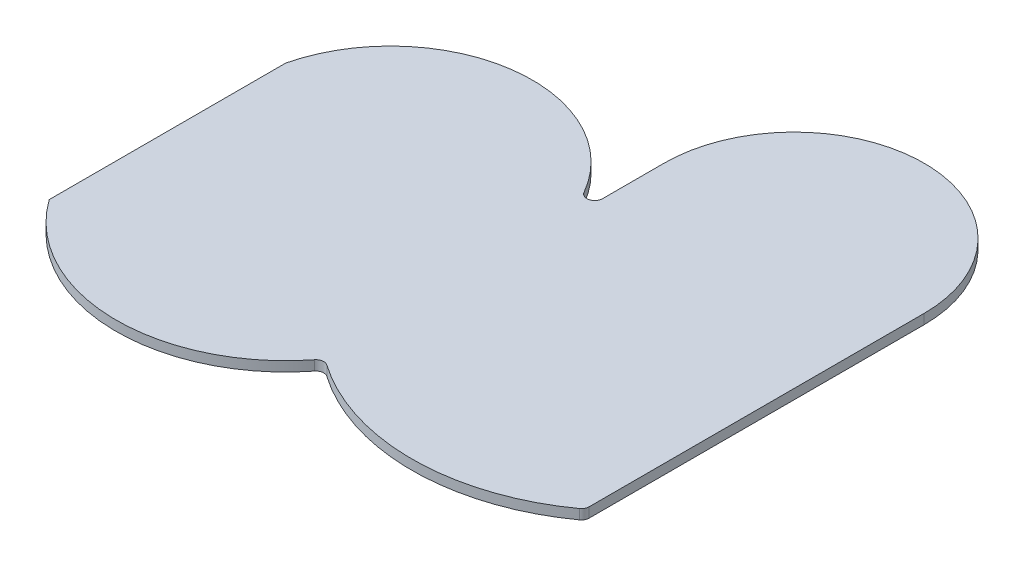
ISO-10303-21;
HEADER;
FILE_DESCRIPTION(('STEP AP214'),'2;1');
FILE_NAME('part.step','',(''),(''),'','','');
FILE_SCHEMA(('AUTOMOTIVE_DESIGN { 1 0 10303 214 1 1 1 1 }'));
ENDSEC;
DATA;
#1=APPLICATION_CONTEXT('core data for automotive mechanical design processes');
#2=APPLICATION_PROTOCOL_DEFINITION('international standard','automotive_design',2000,#1);
#3=PRODUCT_CONTEXT('',#1,'mechanical');
#4=PRODUCT('Part','Part','',(#3));
#5=PRODUCT_RELATED_PRODUCT_CATEGORY('part','',(#4));
#6=PRODUCT_DEFINITION_FORMATION('','',#4);
#7=PRODUCT_DEFINITION_CONTEXT('part definition',#1,'design');
#8=PRODUCT_DEFINITION('design','',#6,#7);
#9=PRODUCT_DEFINITION_SHAPE('','',#8);
#10=(LENGTH_UNIT() NAMED_UNIT(*) SI_UNIT(.MILLI.,.METRE.));
#11=(NAMED_UNIT(*) PLANE_ANGLE_UNIT() SI_UNIT($,.RADIAN.));
#12=(NAMED_UNIT(*) SI_UNIT($,.STERADIAN.) SOLID_ANGLE_UNIT());
#13=UNCERTAINTY_MEASURE_WITH_UNIT(LENGTH_MEASURE(1.E-05),#10,'distance_accuracy_value','');
#14=(GEOMETRIC_REPRESENTATION_CONTEXT(3) GLOBAL_UNCERTAINTY_ASSIGNED_CONTEXT((#13)) GLOBAL_UNIT_ASSIGNED_CONTEXT((#10,
#11,#12)) REPRESENTATION_CONTEXT('',''));
#15=CARTESIAN_POINT('',(0.,0.,0.));
#16=DIRECTION('',(0.,0.,1.));
#17=DIRECTION('',(1.,0.,0.));
#18=AXIS2_PLACEMENT_3D('',#15,#16,#17);
#19=CARTESIAN_POINT('',(0.,6.25,-70.));
#20=DIRECTION('',(0.,-1.,0.));
#21=DIRECTION('',(0.,0.,-1.));
#22=AXIS2_PLACEMENT_3D('',#19,#20,#21);
#23=CYLINDRICAL_SURFACE('',#22,275.);
#24=CARTESIAN_POINT('',(0.,-6.25,-70.));
#25=DIRECTION('',(0.,1.,0.));
#26=DIRECTION('',(0.,0.,1.));
#27=AXIS2_PLACEMENT_3D('',#24,#25,#26);
#28=CIRCLE('',#27,275.);
#29=CARTESIAN_POINT('',(-157.177952382668,-6.25,155.654805587632));
#30=VERTEX_POINT('',#29);
#31=CARTESIAN_POINT('',(160.849056603774,-6.25,153.052865907784));
#32=VERTEX_POINT('',#31);
#33=EDGE_CURVE('E154',#30,#32,#28,.T.);
#34=ORIENTED_EDGE('',*,*,#33,.T.);
#35=DIRECTION('',(0.,-1.,0.));
#36=VECTOR('',#35,1.);
#37=CARTESIAN_POINT('',(160.849056603774,6.25,153.052865907784));
#38=LINE('',#37,#36);
#39=CARTESIAN_POINT('',(160.849056603774,6.25,153.052865907784));
#40=VERTEX_POINT('',#39);
#41=EDGE_CURVE('E181',#32,#40,#38,.F.);
#42=ORIENTED_EDGE('',*,*,#41,.T.);
#43=CARTESIAN_POINT('',(0.,6.25,-70.));
#44=DIRECTION('',(0.,1.,0.));
#45=DIRECTION('',(0.,0.,1.));
#46=AXIS2_PLACEMENT_3D('',#43,#44,#45);
#47=CIRCLE('',#46,275.);
#48=CARTESIAN_POINT('',(-157.177952382668,6.25,155.654805587632));
#49=VERTEX_POINT('',#48);
#50=EDGE_CURVE('E127',#49,#40,#47,.T.);
#51=ORIENTED_EDGE('',*,*,#50,.F.);
#52=DIRECTION('',(0.,-1.,0.));
#53=VECTOR('',#52,1.);
#54=CARTESIAN_POINT('',(-157.177952382668,6.25,155.654805587632));
#55=LINE('',#54,#53);
#56=EDGE_CURVE('E178',#49,#30,#55,.T.);
#57=ORIENTED_EDGE('',*,*,#56,.T.);
#58=EDGE_LOOP('',(#34,#42,#51,#57));
#59=FACE_BOUND('',#58,.T.);
#60=ADVANCED_FACE('F39',(#59),#23,.T.);
#61=CARTESIAN_POINT('',(165.,6.25,-150.));
#62=DIRECTION('',(-1.,0.,0.));
#63=DIRECTION('',(0.,0.,1.));
#64=AXIS2_PLACEMENT_3D('',#61,#62,#63);
#65=PLANE('',#64);
#66=DIRECTION('',(0.,0.,-1.));
#67=VECTOR('',#66,1.);
#68=CARTESIAN_POINT('',(165.,6.25,-150.));
#69=LINE('',#68,#67);
#70=CARTESIAN_POINT('',(165.,6.25,144.941852602047));
#71=VERTEX_POINT('',#70);
#72=CARTESIAN_POINT('',(165.,6.25,-280.));
#73=VERTEX_POINT('',#72);
#74=EDGE_CURVE('E115',#71,#73,#69,.T.);
#75=ORIENTED_EDGE('',*,*,#74,.F.);
#76=DIRECTION('',(0.,-1.,0.));
#77=VECTOR('',#76,1.);
#78=CARTESIAN_POINT('',(165.,6.25,144.941852602047));
#79=LINE('',#78,#77);
#80=CARTESIAN_POINT('',(165.,-6.25,144.941852602047));
#81=VERTEX_POINT('',#80);
#82=EDGE_CURVE('E136',#71,#81,#79,.T.);
#83=ORIENTED_EDGE('',*,*,#82,.T.);
#84=DIRECTION('',(0.,0.,-1.));
#85=VECTOR('',#84,1.);
#86=CARTESIAN_POINT('',(165.,-6.25,-150.));
#87=LINE('',#86,#85);
#88=CARTESIAN_POINT('',(165.,-6.25,-280.));
#89=VERTEX_POINT('',#88);
#90=EDGE_CURVE('E133',#81,#89,#87,.T.);
#91=ORIENTED_EDGE('',*,*,#90,.T.);
#92=DIRECTION('',(0.,-1.,0.));
#93=VECTOR('',#92,1.);
#94=CARTESIAN_POINT('',(165.,6.25,-280.));
#95=LINE('',#94,#93);
#96=EDGE_CURVE('E130',#73,#89,#95,.T.);
#97=ORIENTED_EDGE('',*,*,#96,.F.);
#98=EDGE_LOOP('',(#75,#83,#91,#97));
#99=FACE_BOUND('',#98,.T.);
#100=ADVANCED_FACE('F131',(#99),#65,.F.);
#101=CARTESIAN_POINT('',(0.,6.25,-280.));
#102=DIRECTION('',(0.,-1.,0.));
#103=DIRECTION('',(0.,0.,-1.));
#104=AXIS2_PLACEMENT_3D('',#101,#102,#103);
#105=CYLINDRICAL_SURFACE('',#104,165.);
#106=CARTESIAN_POINT('',(0.,-6.25,-280.));
#107=DIRECTION('',(0.,1.,0.));
#108=DIRECTION('',(0.,0.,-1.));
#109=AXIS2_PLACEMENT_3D('',#106,#107,#108);
#110=CIRCLE('',#109,165.);
#111=CARTESIAN_POINT('',(-165.,-6.25,-280.));
#112=VERTEX_POINT('',#111);
#113=EDGE_CURVE('E158',#89,#112,#110,.T.);
#114=ORIENTED_EDGE('',*,*,#113,.T.);
#115=DIRECTION('',(0.,-1.,0.));
#116=VECTOR('',#115,1.);
#117=CARTESIAN_POINT('',(-165.,6.25,-280.));
#118=LINE('',#117,#116);
#119=CARTESIAN_POINT('',(-165.,6.25,-280.));
#120=VERTEX_POINT('',#119);
#121=EDGE_CURVE('E137',#120,#112,#118,.T.);
#122=ORIENTED_EDGE('',*,*,#121,.F.);
#123=CARTESIAN_POINT('',(0.,6.25,-280.));
#124=DIRECTION('',(0.,1.,0.));
#125=DIRECTION('',(0.,0.,-1.));
#126=AXIS2_PLACEMENT_3D('',#123,#124,#125);
#127=CIRCLE('',#126,165.);
#128=EDGE_CURVE('E120',#73,#120,#127,.T.);
#129=ORIENTED_EDGE('',*,*,#128,.F.);
#130=ORIENTED_EDGE('',*,*,#96,.T.);
#131=EDGE_LOOP('',(#114,#122,#129,#130));
#132=FACE_BOUND('',#131,.T.);
#133=ADVANCED_FACE('F139',(#132),#105,.T.);
#134=CARTESIAN_POINT('',(-165.,6.25,-150.));
#135=DIRECTION('',(1.,0.,0.));
#136=DIRECTION('',(0.,0.,-1.));
#137=AXIS2_PLACEMENT_3D('',#134,#135,#136);
#138=PLANE('',#137);
#139=DIRECTION('',(0.,0.,1.));
#140=VECTOR('',#139,1.);
#141=CARTESIAN_POINT('',(-165.,-6.25,-150.));
#142=LINE('',#141,#140);
#143=CARTESIAN_POINT('',(-165.,-6.25,-202.076469541202));
#144=VERTEX_POINT('',#143);
#145=EDGE_CURVE('E160',#112,#144,#142,.T.);
#146=ORIENTED_EDGE('',*,*,#145,.T.);
#147=DIRECTION('',(0.,1.,0.));
#148=VECTOR('',#147,1.);
#149=CARTESIAN_POINT('',(-165.,6.25,-202.076469541202));
#150=LINE('',#149,#148);
#151=CARTESIAN_POINT('',(-165.,6.25,-202.076469541202));
#152=VERTEX_POINT('',#151);
#153=EDGE_CURVE('E188',#144,#152,#150,.T.);
#154=ORIENTED_EDGE('',*,*,#153,.T.);
#155=DIRECTION('',(0.,0.,1.));
#156=VECTOR('',#155,1.);
#157=CARTESIAN_POINT('',(-165.,6.25,-150.));
#158=LINE('',#157,#156);
#159=EDGE_CURVE('E142',#120,#152,#158,.T.);
#160=ORIENTED_EDGE('',*,*,#159,.F.);
#161=ORIENTED_EDGE('',*,*,#121,.T.);
#162=EDGE_LOOP('',(#146,#154,#160,#161));
#163=FACE_BOUND('',#162,.T.);
#164=ADVANCED_FACE('F202',(#163),#138,.F.);
#165=CARTESIAN_POINT('',(-340.,6.25,-107.869251134118));
#166=DIRECTION('',(0.,-1.,0.));
#167=DIRECTION('',(0.,0.,-1.));
#168=AXIS2_PLACEMENT_3D('',#165,#166,#167);
#169=CYLINDRICAL_SURFACE('',#168,180.);
#170=CARTESIAN_POINT('',(-340.,6.25,-107.869251134118));
#171=DIRECTION('',(0.,1.,0.));
#172=DIRECTION('',(0.,0.,-1.));
#173=AXIS2_PLACEMENT_3D('',#170,#171,#172);
#174=CIRCLE('',#173,180.);
#175=CARTESIAN_POINT('',(-183.684210526316,6.25,-197.118194888198));
#176=VERTEX_POINT('',#175);
#177=CARTESIAN_POINT('',(-515.,6.25,-150.));
#178=VERTEX_POINT('',#177);
#179=EDGE_CURVE('E144',#176,#178,#174,.T.);
#180=ORIENTED_EDGE('',*,*,#179,.F.);
#181=DIRECTION('',(0.,-1.,0.));
#182=VECTOR('',#181,1.);
#183=CARTESIAN_POINT('',(-183.684210526316,6.25,-197.118194888198));
#184=LINE('',#183,#182);
#185=CARTESIAN_POINT('',(-183.684210526316,-6.25,-197.118194888198));
#186=VERTEX_POINT('',#185);
#187=EDGE_CURVE('E185',#176,#186,#184,.T.);
#188=ORIENTED_EDGE('',*,*,#187,.T.);
#189=CARTESIAN_POINT('',(-340.,-6.25,-107.869251134118));
#190=DIRECTION('',(0.,1.,0.));
#191=DIRECTION('',(0.,0.,-1.));
#192=AXIS2_PLACEMENT_3D('',#189,#190,#191);
#193=CIRCLE('',#192,180.);
#194=CARTESIAN_POINT('',(-515.,-6.25,-150.));
#195=VERTEX_POINT('',#194);
#196=EDGE_CURVE('E163',#186,#195,#193,.T.);
#197=ORIENTED_EDGE('',*,*,#196,.T.);
#198=DIRECTION('',(0.,-1.,0.));
#199=VECTOR('',#198,1.);
#200=CARTESIAN_POINT('',(-515.,6.25,-150.));
#201=LINE('',#200,#199);
#202=EDGE_CURVE('E171',#178,#195,#201,.T.);
#203=ORIENTED_EDGE('',*,*,#202,.F.);
#204=EDGE_LOOP('',(#180,#188,#197,#203));
#205=FACE_BOUND('',#204,.T.);
#206=ADVANCED_FACE('F204',(#205),#169,.T.);
#207=CARTESIAN_POINT('',(-515.,6.25,-150.));
#208=DIRECTION('',(1.,0.,0.));
#209=DIRECTION('',(0.,0.,-1.));
#210=AXIS2_PLACEMENT_3D('',#207,#208,#209);
#211=PLANE('',#210);
#212=DIRECTION('',(0.,0.,1.));
#213=VECTOR('',#212,1.);
#214=CARTESIAN_POINT('',(-515.,-6.25,-150.));
#215=LINE('',#214,#213);
#216=CARTESIAN_POINT('',(-515.,-6.25,150.));
#217=VERTEX_POINT('',#216);
#218=EDGE_CURVE('E165',#195,#217,#215,.T.);
#219=ORIENTED_EDGE('',*,*,#218,.T.);
#220=DIRECTION('',(0.,-1.,0.));
#221=VECTOR('',#220,1.);
#222=CARTESIAN_POINT('',(-515.,6.25,150.));
#223=LINE('',#222,#221);
#224=CARTESIAN_POINT('',(-515.,6.25,150.));
#225=VERTEX_POINT('',#224);
#226=EDGE_CURVE('E153',#225,#217,#223,.T.);
#227=ORIENTED_EDGE('',*,*,#226,.F.);
#228=DIRECTION('',(0.,0.,1.));
#229=VECTOR('',#228,1.);
#230=CARTESIAN_POINT('',(-515.,6.25,-150.));
#231=LINE('',#230,#229);
#232=EDGE_CURVE('E149',#178,#225,#231,.T.);
#233=ORIENTED_EDGE('',*,*,#232,.F.);
#234=ORIENTED_EDGE('',*,*,#202,.T.);
#235=EDGE_LOOP('',(#219,#227,#233,#234));
#236=FACE_BOUND('',#235,.T.);
#237=ADVANCED_FACE('F210',(#236),#211,.F.);
#238=CARTESIAN_POINT('',(-340.,6.25,24.8611111111112));
#239=DIRECTION('',(0.,-1.,0.));
#240=DIRECTION('',(0.,0.,-1.));
#241=AXIS2_PLACEMENT_3D('',#238,#239,#240);
#242=CYLINDRICAL_SURFACE('',#241,215.138888888889);
#243=CARTESIAN_POINT('',(-340.,-6.25,24.8611111111112));
#244=DIRECTION('',(0.,1.,0.));
#245=DIRECTION('',(0.,0.,1.));
#246=AXIS2_PLACEMENT_3D('',#243,#244,#245);
#247=CIRCLE('',#246,215.138888888889);
#248=CARTESIAN_POINT('',(-170.760057761459,-6.25,157.686498230596));
#249=VERTEX_POINT('',#248);
#250=EDGE_CURVE('E167',#217,#249,#247,.T.);
#251=ORIENTED_EDGE('',*,*,#250,.T.);
#252=DIRECTION('',(0.,-1.,0.));
#253=VECTOR('',#252,1.);
#254=CARTESIAN_POINT('',(-170.760057761459,6.25,157.686498230596));
#255=LINE('',#254,#253);
#256=CARTESIAN_POINT('',(-170.760057761459,6.25,157.686498230596));
#257=VERTEX_POINT('',#256);
#258=EDGE_CURVE('E54',#249,#257,#255,.F.);
#259=ORIENTED_EDGE('',*,*,#258,.T.);
#260=CARTESIAN_POINT('',(-340.,6.25,24.8611111111112));
#261=DIRECTION('',(0.,1.,0.));
#262=DIRECTION('',(0.,0.,1.));
#263=AXIS2_PLACEMENT_3D('',#260,#261,#262);
#264=CIRCLE('',#263,215.138888888889);
#265=EDGE_CURVE('E151',#225,#257,#264,.T.);
#266=ORIENTED_EDGE('',*,*,#265,.F.);
#267=ORIENTED_EDGE('',*,*,#226,.T.);
#268=EDGE_LOOP('',(#251,#259,#266,#267));
#269=FACE_BOUND('',#268,.T.);
#270=ADVANCED_FACE('F212',(#269),#242,.T.);
#271=CARTESIAN_POINT('',(0.,6.25,-70.));
#272=DIRECTION('',(0.,1.,0.));
#273=DIRECTION('',(0.,0.,1.));
#274=AXIS2_PLACEMENT_3D('',#271,#272,#273);
#275=PLANE('',#274);
#276=ORIENTED_EDGE('',*,*,#50,.T.);
#277=CARTESIAN_POINT('',(155.,6.25,144.941852602047));
#278=DIRECTION('',(0.,1.,0.));
#279=DIRECTION('',(0.,0.,1.));
#280=AXIS2_PLACEMENT_3D('',#277,#278,#279);
#281=CIRCLE('',#280,10.);
#282=EDGE_CURVE('E123',#40,#71,#281,.T.);
#283=ORIENTED_EDGE('',*,*,#282,.T.);
#284=ORIENTED_EDGE('',*,*,#74,.T.);
#285=ORIENTED_EDGE('',*,*,#128,.T.);
#286=ORIENTED_EDGE('',*,*,#159,.T.);
#287=CARTESIAN_POINT('',(-175.,6.25,-202.076469541202));
#288=DIRECTION('',(0.,1.,0.));
#289=DIRECTION('',(0.,0.,1.));
#290=AXIS2_PLACEMENT_3D('',#287,#288,#289);
#291=CIRCLE('',#290,10.);
#292=EDGE_CURVE('E11',#152,#176,#291,.F.);
#293=ORIENTED_EDGE('',*,*,#292,.T.);
#294=ORIENTED_EDGE('',*,*,#179,.T.);
#295=ORIENTED_EDGE('',*,*,#232,.T.);
#296=ORIENTED_EDGE('',*,*,#265,.T.);
#297=CARTESIAN_POINT('',(-162.893514287492,6.25,163.860434881727));
#298=DIRECTION('',(0.,1.,0.));
#299=DIRECTION('',(0.,0.,1.));
#300=AXIS2_PLACEMENT_3D('',#297,#298,#299);
#301=CIRCLE('',#300,10.);
#302=EDGE_CURVE('E192',#257,#49,#301,.F.);
#303=ORIENTED_EDGE('',*,*,#302,.T.);
#304=EDGE_LOOP('',(#276,#283,#284,#285,#286,#293,#294,#295,#296,#303));
#305=FACE_BOUND('',#304,.T.);
#306=ADVANCED_FACE('F118',(#305),#275,.T.);
#307=CARTESIAN_POINT('',(0.,-6.25,-70.));
#308=DIRECTION('',(0.,1.,0.));
#309=DIRECTION('',(0.,0.,1.));
#310=AXIS2_PLACEMENT_3D('',#307,#308,#309);
#311=PLANE('',#310);
#312=ORIENTED_EDGE('',*,*,#90,.F.);
#313=CARTESIAN_POINT('',(155.,-6.25,144.941852602047));
#314=DIRECTION('',(0.,1.,0.));
#315=DIRECTION('',(0.,0.,1.));
#316=AXIS2_PLACEMENT_3D('',#313,#314,#315);
#317=CIRCLE('',#316,10.);
#318=EDGE_CURVE('E176',#81,#32,#317,.F.);
#319=ORIENTED_EDGE('',*,*,#318,.T.);
#320=ORIENTED_EDGE('',*,*,#33,.F.);
#321=CARTESIAN_POINT('',(-162.893514287492,-6.25,163.860434881727));
#322=DIRECTION('',(0.,1.,0.));
#323=DIRECTION('',(0.,0.,1.));
#324=AXIS2_PLACEMENT_3D('',#321,#322,#323);
#325=CIRCLE('',#324,10.);
#326=EDGE_CURVE('E190',#30,#249,#325,.T.);
#327=ORIENTED_EDGE('',*,*,#326,.T.);
#328=ORIENTED_EDGE('',*,*,#250,.F.);
#329=ORIENTED_EDGE('',*,*,#218,.F.);
#330=ORIENTED_EDGE('',*,*,#196,.F.);
#331=CARTESIAN_POINT('',(-175.,-6.25,-202.076469541202));
#332=DIRECTION('',(0.,1.,0.));
#333=DIRECTION('',(0.,0.,1.));
#334=AXIS2_PLACEMENT_3D('',#331,#332,#333);
#335=CIRCLE('',#334,10.);
#336=EDGE_CURVE('E47',#186,#144,#335,.T.);
#337=ORIENTED_EDGE('',*,*,#336,.T.);
#338=ORIENTED_EDGE('',*,*,#145,.F.);
#339=ORIENTED_EDGE('',*,*,#113,.F.);
#340=EDGE_LOOP('',(#312,#319,#320,#327,#328,#329,#330,#337,#338,#339));
#341=FACE_BOUND('',#340,.T.);
#342=ADVANCED_FACE('F196',(#341),#311,.F.);
#343=CARTESIAN_POINT('',(155.,6.25,144.941852602047));
#344=DIRECTION('',(0.,-1.,0.));
#345=DIRECTION('',(0.,0.,-1.));
#346=AXIS2_PLACEMENT_3D('',#343,#344,#345);
#347=CYLINDRICAL_SURFACE('',#346,10.);
#348=ORIENTED_EDGE('',*,*,#282,.F.);
#349=ORIENTED_EDGE('',*,*,#41,.F.);
#350=ORIENTED_EDGE('',*,*,#318,.F.);
#351=ORIENTED_EDGE('',*,*,#82,.F.);
#352=EDGE_LOOP('',(#348,#349,#350,#351));
#353=FACE_BOUND('',#352,.T.);
#354=ADVANCED_FACE('F232',(#353),#347,.T.);
#355=CARTESIAN_POINT('',(-162.893514287492,6.25,163.860434881727));
#356=DIRECTION('',(0.,1.,0.));
#357=DIRECTION('',(0.,0.,1.));
#358=AXIS2_PLACEMENT_3D('',#355,#356,#357);
#359=CYLINDRICAL_SURFACE('',#358,10.);
#360=ORIENTED_EDGE('',*,*,#302,.F.);
#361=ORIENTED_EDGE('',*,*,#258,.F.);
#362=ORIENTED_EDGE('',*,*,#326,.F.);
#363=ORIENTED_EDGE('',*,*,#56,.F.);
#364=EDGE_LOOP('',(#360,#361,#362,#363));
#365=FACE_BOUND('',#364,.T.);
#366=ADVANCED_FACE('F234',(#365),#359,.F.);
#367=CARTESIAN_POINT('',(-175.,6.25,-202.076469541202));
#368=DIRECTION('',(0.,-1.,0.));
#369=DIRECTION('',(0.,0.,-1.));
#370=AXIS2_PLACEMENT_3D('',#367,#368,#369);
#371=CYLINDRICAL_SURFACE('',#370,10.);
#372=ORIENTED_EDGE('',*,*,#292,.F.);
#373=ORIENTED_EDGE('',*,*,#153,.F.);
#374=ORIENTED_EDGE('',*,*,#336,.F.);
#375=ORIENTED_EDGE('',*,*,#187,.F.);
#376=EDGE_LOOP('',(#372,#373,#374,#375));
#377=FACE_BOUND('',#376,.T.);
#378=ADVANCED_FACE('F41',(#377),#371,.F.);
#379=CLOSED_SHELL('',(#60,#100,#133,#164,#206,#237,#270,#306,#342,#354,#366,#378));
#380=MANIFOLD_SOLID_BREP('B2',#379);
#381=ADVANCED_BREP_SHAPE_REPRESENTATION('',(#18,#380),#14);
#382=SHAPE_DEFINITION_REPRESENTATION(#9,#381);
ENDSEC;
END-ISO-10303-21;
